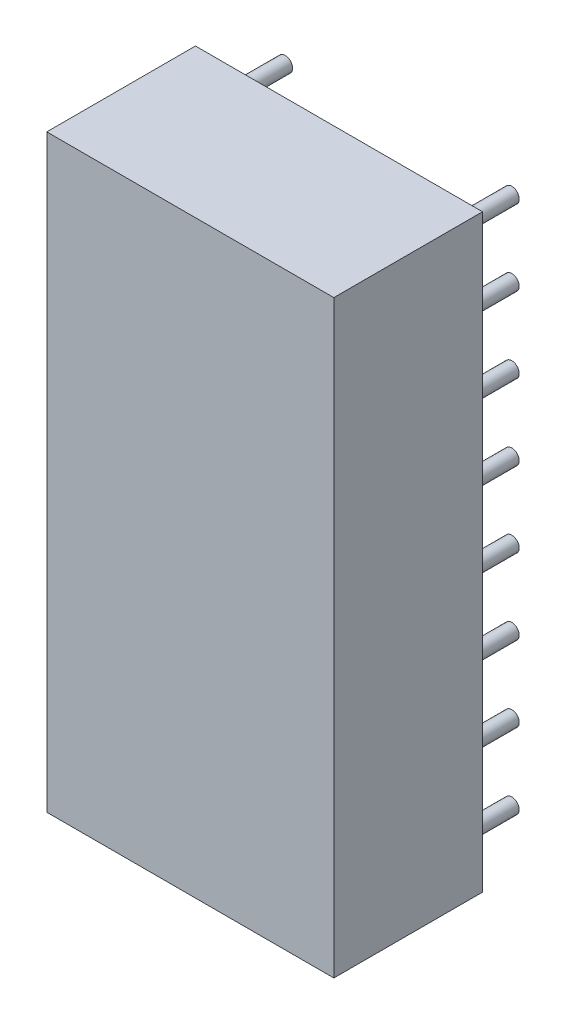
ISO-10303-21;
HEADER;
FILE_DESCRIPTION(('STEP AP214'),'2;1');
FILE_NAME('part.step','',(''),(''),'','','');
FILE_SCHEMA(('AUTOMOTIVE_DESIGN { 1 0 10303 214 1 1 1 1 }'));
ENDSEC;
DATA;
#1=APPLICATION_CONTEXT('core data for automotive mechanical design processes');
#2=APPLICATION_PROTOCOL_DEFINITION('international standard','automotive_design',2000,#1);
#3=PRODUCT_CONTEXT('',#1,'mechanical');
#4=PRODUCT('Part','Part','',(#3));
#5=PRODUCT_RELATED_PRODUCT_CATEGORY('part','',(#4));
#6=PRODUCT_DEFINITION_FORMATION('','',#4);
#7=PRODUCT_DEFINITION_CONTEXT('part definition',#1,'design');
#8=PRODUCT_DEFINITION('design','',#6,#7);
#9=PRODUCT_DEFINITION_SHAPE('','',#8);
#10=(LENGTH_UNIT() NAMED_UNIT(*) SI_UNIT(.MILLI.,.METRE.));
#11=(NAMED_UNIT(*) PLANE_ANGLE_UNIT() SI_UNIT($,.RADIAN.));
#12=(NAMED_UNIT(*) SI_UNIT($,.STERADIAN.) SOLID_ANGLE_UNIT());
#13=UNCERTAINTY_MEASURE_WITH_UNIT(LENGTH_MEASURE(1.E-05),#10,'distance_accuracy_value','');
#14=(GEOMETRIC_REPRESENTATION_CONTEXT(3) GLOBAL_UNCERTAINTY_ASSIGNED_CONTEXT((#13)) GLOBAL_UNIT_ASSIGNED_CONTEXT((#10,
#11,#12)) REPRESENTATION_CONTEXT('',''));
#15=CARTESIAN_POINT('',(0.,0.,0.));
#16=DIRECTION('',(0.,0.,1.));
#17=DIRECTION('',(1.,0.,0.));
#18=AXIS2_PLACEMENT_3D('',#15,#16,#17);
#19=CARTESIAN_POINT('',(8.89,19.05,-2.));
#20=DIRECTION('',(0.,0.,1.));
#21=DIRECTION('',(1.,0.,0.));
#22=AXIS2_PLACEMENT_3D('',#19,#20,#21);
#23=CYLINDRICAL_SURFACE('',#22,0.25);
#24=CARTESIAN_POINT('',(8.89,19.05,-2.));
#25=DIRECTION('',(0.,0.,1.));
#26=DIRECTION('',(1.,0.,0.));
#27=AXIS2_PLACEMENT_3D('',#24,#25,#26);
#28=CIRCLE('',#27,0.25);
#29=CARTESIAN_POINT('',(9.14,19.05,-2.));
#30=VERTEX_POINT('',#29);
#31=EDGE_CURVE('E11',#30,#30,#28,.T.);
#32=ORIENTED_EDGE('',*,*,#31,.T.);
#33=EDGE_LOOP('',(#32));
#34=FACE_BOUND('',#33,.T.);
#35=CARTESIAN_POINT('',(8.89,19.05,0.));
#36=DIRECTION('',(0.,0.,1.));
#37=DIRECTION('',(1.,0.,0.));
#38=AXIS2_PLACEMENT_3D('',#35,#36,#37);
#39=CIRCLE('',#38,0.25);
#40=CARTESIAN_POINT('',(9.14,19.05,0.));
#41=VERTEX_POINT('',#40);
#42=EDGE_CURVE('E43',#41,#41,#39,.T.);
#43=ORIENTED_EDGE('',*,*,#42,.F.);
#44=EDGE_LOOP('',(#43));
#45=FACE_BOUND('',#44,.T.);
#46=ADVANCED_FACE('F40',(#34,#45),#23,.T.);
#47=CARTESIAN_POINT('',(8.89,19.05,-2.));
#48=DIRECTION('',(0.,0.,1.));
#49=DIRECTION('',(1.,0.,0.));
#50=AXIS2_PLACEMENT_3D('',#47,#48,#49);
#51=PLANE('',#50);
#52=ORIENTED_EDGE('',*,*,#31,.F.);
#53=EDGE_LOOP('',(#52));
#54=FACE_BOUND('',#53,.T.);
#55=ADVANCED_FACE('F55',(#54),#51,.F.);
#56=CARTESIAN_POINT('',(8.89,19.05,0.));
#57=DIRECTION('',(0.,0.,1.));
#58=DIRECTION('',(1.,0.,0.));
#59=AXIS2_PLACEMENT_3D('',#56,#57,#58);
#60=PLANE('',#59);
#61=ORIENTED_EDGE('',*,*,#42,.T.);
#62=EDGE_LOOP('',(#61));
#63=FACE_BOUND('',#62,.T.);
#64=ADVANCED_FACE('F52',(#63),#60,.T.);
#65=CLOSED_SHELL('',(#46,#55,#64));
#66=MANIFOLD_SOLID_BREP('B2',#65);
#67=CARTESIAN_POINT('',(8.89,16.51,-2.));
#68=DIRECTION('',(0.,0.,1.));
#69=DIRECTION('',(1.,0.,0.));
#70=AXIS2_PLACEMENT_3D('',#67,#68,#69);
#71=CYLINDRICAL_SURFACE('',#70,0.25);
#72=CARTESIAN_POINT('',(8.89,16.51,-2.));
#73=DIRECTION('',(0.,0.,1.));
#74=DIRECTION('',(1.,0.,0.));
#75=AXIS2_PLACEMENT_3D('',#72,#73,#74);
#76=CIRCLE('',#75,0.25);
#77=CARTESIAN_POINT('',(9.14,16.51,-2.));
#78=VERTEX_POINT('',#77);
#79=EDGE_CURVE('E39',#78,#78,#76,.T.);
#80=ORIENTED_EDGE('',*,*,#79,.T.);
#81=EDGE_LOOP('',(#80));
#82=FACE_BOUND('',#81,.T.);
#83=CARTESIAN_POINT('',(8.89,16.51,0.));
#84=DIRECTION('',(0.,0.,1.));
#85=DIRECTION('',(1.,0.,0.));
#86=AXIS2_PLACEMENT_3D('',#83,#84,#85);
#87=CIRCLE('',#86,0.25);
#88=CARTESIAN_POINT('',(9.14,16.51,0.));
#89=VERTEX_POINT('',#88);
#90=EDGE_CURVE('E92',#89,#89,#87,.T.);
#91=ORIENTED_EDGE('',*,*,#90,.F.);
#92=EDGE_LOOP('',(#91));
#93=FACE_BOUND('',#92,.T.);
#94=ADVANCED_FACE('F89',(#82,#93),#71,.T.);
#95=CARTESIAN_POINT('',(8.89,16.51,-2.));
#96=DIRECTION('',(0.,0.,1.));
#97=DIRECTION('',(1.,0.,0.));
#98=AXIS2_PLACEMENT_3D('',#95,#96,#97);
#99=PLANE('',#98);
#100=ORIENTED_EDGE('',*,*,#79,.F.);
#101=EDGE_LOOP('',(#100));
#102=FACE_BOUND('',#101,.T.);
#103=ADVANCED_FACE('F104',(#102),#99,.F.);
#104=CARTESIAN_POINT('',(8.89,16.51,0.));
#105=DIRECTION('',(0.,0.,1.));
#106=DIRECTION('',(1.,0.,0.));
#107=AXIS2_PLACEMENT_3D('',#104,#105,#106);
#108=PLANE('',#107);
#109=ORIENTED_EDGE('',*,*,#90,.T.);
#110=EDGE_LOOP('',(#109));
#111=FACE_BOUND('',#110,.T.);
#112=ADVANCED_FACE('F101',(#111),#108,.T.);
#113=CLOSED_SHELL('',(#94,#103,#112));
#114=MANIFOLD_SOLID_BREP('B6',#113);
#115=CARTESIAN_POINT('',(8.89,13.97,-2.));
#116=DIRECTION('',(0.,0.,1.));
#117=DIRECTION('',(1.,0.,0.));
#118=AXIS2_PLACEMENT_3D('',#115,#116,#117);
#119=CYLINDRICAL_SURFACE('',#118,0.25);
#120=CARTESIAN_POINT('',(8.89,13.97,-2.));
#121=DIRECTION('',(0.,0.,1.));
#122=DIRECTION('',(1.,0.,0.));
#123=AXIS2_PLACEMENT_3D('',#120,#121,#122);
#124=CIRCLE('',#123,0.25);
#125=CARTESIAN_POINT('',(9.14,13.97,-2.));
#126=VERTEX_POINT('',#125);
#127=EDGE_CURVE('E88',#126,#126,#124,.T.);
#128=ORIENTED_EDGE('',*,*,#127,.T.);
#129=EDGE_LOOP('',(#128));
#130=FACE_BOUND('',#129,.T.);
#131=CARTESIAN_POINT('',(8.89,13.97,0.));
#132=DIRECTION('',(0.,0.,1.));
#133=DIRECTION('',(1.,0.,0.));
#134=AXIS2_PLACEMENT_3D('',#131,#132,#133);
#135=CIRCLE('',#134,0.25);
#136=CARTESIAN_POINT('',(9.14,13.97,0.));
#137=VERTEX_POINT('',#136);
#138=EDGE_CURVE('E141',#137,#137,#135,.T.);
#139=ORIENTED_EDGE('',*,*,#138,.F.);
#140=EDGE_LOOP('',(#139));
#141=FACE_BOUND('',#140,.T.);
#142=ADVANCED_FACE('F138',(#130,#141),#119,.T.);
#143=CARTESIAN_POINT('',(8.89,13.97,-2.));
#144=DIRECTION('',(0.,0.,1.));
#145=DIRECTION('',(1.,0.,0.));
#146=AXIS2_PLACEMENT_3D('',#143,#144,#145);
#147=PLANE('',#146);
#148=ORIENTED_EDGE('',*,*,#127,.F.);
#149=EDGE_LOOP('',(#148));
#150=FACE_BOUND('',#149,.T.);
#151=ADVANCED_FACE('F153',(#150),#147,.F.);
#152=CARTESIAN_POINT('',(8.89,13.97,0.));
#153=DIRECTION('',(0.,0.,1.));
#154=DIRECTION('',(1.,0.,0.));
#155=AXIS2_PLACEMENT_3D('',#152,#153,#154);
#156=PLANE('',#155);
#157=ORIENTED_EDGE('',*,*,#138,.T.);
#158=EDGE_LOOP('',(#157));
#159=FACE_BOUND('',#158,.T.);
#160=ADVANCED_FACE('F150',(#159),#156,.T.);
#161=CLOSED_SHELL('',(#142,#151,#160));
#162=MANIFOLD_SOLID_BREP('B34',#161);
#163=CARTESIAN_POINT('',(8.89,11.43,-2.));
#164=DIRECTION('',(0.,0.,1.));
#165=DIRECTION('',(1.,0.,0.));
#166=AXIS2_PLACEMENT_3D('',#163,#164,#165);
#167=CYLINDRICAL_SURFACE('',#166,0.25);
#168=CARTESIAN_POINT('',(8.89,11.43,-2.));
#169=DIRECTION('',(0.,0.,1.));
#170=DIRECTION('',(1.,0.,0.));
#171=AXIS2_PLACEMENT_3D('',#168,#169,#170);
#172=CIRCLE('',#171,0.25);
#173=CARTESIAN_POINT('',(9.14,11.43,-2.));
#174=VERTEX_POINT('',#173);
#175=EDGE_CURVE('E137',#174,#174,#172,.T.);
#176=ORIENTED_EDGE('',*,*,#175,.T.);
#177=EDGE_LOOP('',(#176));
#178=FACE_BOUND('',#177,.T.);
#179=CARTESIAN_POINT('',(8.89,11.43,0.));
#180=DIRECTION('',(0.,0.,1.));
#181=DIRECTION('',(1.,0.,0.));
#182=AXIS2_PLACEMENT_3D('',#179,#180,#181);
#183=CIRCLE('',#182,0.25);
#184=CARTESIAN_POINT('',(9.14,11.43,0.));
#185=VERTEX_POINT('',#184);
#186=EDGE_CURVE('E190',#185,#185,#183,.T.);
#187=ORIENTED_EDGE('',*,*,#186,.F.);
#188=EDGE_LOOP('',(#187));
#189=FACE_BOUND('',#188,.T.);
#190=ADVANCED_FACE('F187',(#178,#189),#167,.T.);
#191=CARTESIAN_POINT('',(8.89,11.43,-2.));
#192=DIRECTION('',(0.,0.,1.));
#193=DIRECTION('',(1.,0.,0.));
#194=AXIS2_PLACEMENT_3D('',#191,#192,#193);
#195=PLANE('',#194);
#196=ORIENTED_EDGE('',*,*,#175,.F.);
#197=EDGE_LOOP('',(#196));
#198=FACE_BOUND('',#197,.T.);
#199=ADVANCED_FACE('F202',(#198),#195,.F.);
#200=CARTESIAN_POINT('',(8.89,11.43,0.));
#201=DIRECTION('',(0.,0.,1.));
#202=DIRECTION('',(1.,0.,0.));
#203=AXIS2_PLACEMENT_3D('',#200,#201,#202);
#204=PLANE('',#203);
#205=ORIENTED_EDGE('',*,*,#186,.T.);
#206=EDGE_LOOP('',(#205));
#207=FACE_BOUND('',#206,.T.);
#208=ADVANCED_FACE('F199',(#207),#204,.T.);
#209=CLOSED_SHELL('',(#190,#199,#208));
#210=MANIFOLD_SOLID_BREP('B83',#209);
#211=CARTESIAN_POINT('',(8.89,8.89,-2.));
#212=DIRECTION('',(0.,0.,1.));
#213=DIRECTION('',(1.,0.,0.));
#214=AXIS2_PLACEMENT_3D('',#211,#212,#213);
#215=CYLINDRICAL_SURFACE('',#214,0.25);
#216=CARTESIAN_POINT('',(8.89,8.89,-2.));
#217=DIRECTION('',(0.,0.,1.));
#218=DIRECTION('',(1.,0.,0.));
#219=AXIS2_PLACEMENT_3D('',#216,#217,#218);
#220=CIRCLE('',#219,0.25);
#221=CARTESIAN_POINT('',(9.14,8.89,-2.));
#222=VERTEX_POINT('',#221);
#223=EDGE_CURVE('E186',#222,#222,#220,.T.);
#224=ORIENTED_EDGE('',*,*,#223,.T.);
#225=EDGE_LOOP('',(#224));
#226=FACE_BOUND('',#225,.T.);
#227=CARTESIAN_POINT('',(8.89,8.89,0.));
#228=DIRECTION('',(0.,0.,1.));
#229=DIRECTION('',(1.,0.,0.));
#230=AXIS2_PLACEMENT_3D('',#227,#228,#229);
#231=CIRCLE('',#230,0.25);
#232=CARTESIAN_POINT('',(9.14,8.89,0.));
#233=VERTEX_POINT('',#232);
#234=EDGE_CURVE('E239',#233,#233,#231,.T.);
#235=ORIENTED_EDGE('',*,*,#234,.F.);
#236=EDGE_LOOP('',(#235));
#237=FACE_BOUND('',#236,.T.);
#238=ADVANCED_FACE('F236',(#226,#237),#215,.T.);
#239=CARTESIAN_POINT('',(8.89,8.89,-2.));
#240=DIRECTION('',(0.,0.,1.));
#241=DIRECTION('',(1.,0.,0.));
#242=AXIS2_PLACEMENT_3D('',#239,#240,#241);
#243=PLANE('',#242);
#244=ORIENTED_EDGE('',*,*,#223,.F.);
#245=EDGE_LOOP('',(#244));
#246=FACE_BOUND('',#245,.T.);
#247=ADVANCED_FACE('F251',(#246),#243,.F.);
#248=CARTESIAN_POINT('',(8.89,8.89,0.));
#249=DIRECTION('',(0.,0.,1.));
#250=DIRECTION('',(1.,0.,0.));
#251=AXIS2_PLACEMENT_3D('',#248,#249,#250);
#252=PLANE('',#251);
#253=ORIENTED_EDGE('',*,*,#234,.T.);
#254=EDGE_LOOP('',(#253));
#255=FACE_BOUND('',#254,.T.);
#256=ADVANCED_FACE('F248',(#255),#252,.T.);
#257=CLOSED_SHELL('',(#238,#247,#256));
#258=MANIFOLD_SOLID_BREP('B132',#257);
#259=CARTESIAN_POINT('',(8.89,6.35,-2.));
#260=DIRECTION('',(0.,0.,1.));
#261=DIRECTION('',(1.,0.,0.));
#262=AXIS2_PLACEMENT_3D('',#259,#260,#261);
#263=CYLINDRICAL_SURFACE('',#262,0.25);
#264=CARTESIAN_POINT('',(8.89,6.35,-2.));
#265=DIRECTION('',(0.,0.,1.));
#266=DIRECTION('',(1.,0.,0.));
#267=AXIS2_PLACEMENT_3D('',#264,#265,#266);
#268=CIRCLE('',#267,0.25);
#269=CARTESIAN_POINT('',(9.14,6.35,-2.));
#270=VERTEX_POINT('',#269);
#271=EDGE_CURVE('E235',#270,#270,#268,.T.);
#272=ORIENTED_EDGE('',*,*,#271,.T.);
#273=EDGE_LOOP('',(#272));
#274=FACE_BOUND('',#273,.T.);
#275=CARTESIAN_POINT('',(8.89,6.35,0.));
#276=DIRECTION('',(0.,0.,1.));
#277=DIRECTION('',(1.,0.,0.));
#278=AXIS2_PLACEMENT_3D('',#275,#276,#277);
#279=CIRCLE('',#278,0.25);
#280=CARTESIAN_POINT('',(9.14,6.35,0.));
#281=VERTEX_POINT('',#280);
#282=EDGE_CURVE('E288',#281,#281,#279,.T.);
#283=ORIENTED_EDGE('',*,*,#282,.F.);
#284=EDGE_LOOP('',(#283));
#285=FACE_BOUND('',#284,.T.);
#286=ADVANCED_FACE('F285',(#274,#285),#263,.T.);
#287=CARTESIAN_POINT('',(8.89,6.35,-2.));
#288=DIRECTION('',(0.,0.,1.));
#289=DIRECTION('',(1.,0.,0.));
#290=AXIS2_PLACEMENT_3D('',#287,#288,#289);
#291=PLANE('',#290);
#292=ORIENTED_EDGE('',*,*,#271,.F.);
#293=EDGE_LOOP('',(#292));
#294=FACE_BOUND('',#293,.T.);
#295=ADVANCED_FACE('F300',(#294),#291,.F.);
#296=CARTESIAN_POINT('',(8.89,6.35,0.));
#297=DIRECTION('',(0.,0.,1.));
#298=DIRECTION('',(1.,0.,0.));
#299=AXIS2_PLACEMENT_3D('',#296,#297,#298);
#300=PLANE('',#299);
#301=ORIENTED_EDGE('',*,*,#282,.T.);
#302=EDGE_LOOP('',(#301));
#303=FACE_BOUND('',#302,.T.);
#304=ADVANCED_FACE('F297',(#303),#300,.T.);
#305=CLOSED_SHELL('',(#286,#295,#304));
#306=MANIFOLD_SOLID_BREP('B181',#305);
#307=CARTESIAN_POINT('',(8.89,3.81,-2.));
#308=DIRECTION('',(0.,0.,1.));
#309=DIRECTION('',(1.,0.,0.));
#310=AXIS2_PLACEMENT_3D('',#307,#308,#309);
#311=CYLINDRICAL_SURFACE('',#310,0.25);
#312=CARTESIAN_POINT('',(8.89,3.81,-2.));
#313=DIRECTION('',(0.,0.,1.));
#314=DIRECTION('',(1.,0.,0.));
#315=AXIS2_PLACEMENT_3D('',#312,#313,#314);
#316=CIRCLE('',#315,0.25);
#317=CARTESIAN_POINT('',(9.14,3.81,-2.));
#318=VERTEX_POINT('',#317);
#319=EDGE_CURVE('E284',#318,#318,#316,.T.);
#320=ORIENTED_EDGE('',*,*,#319,.T.);
#321=EDGE_LOOP('',(#320));
#322=FACE_BOUND('',#321,.T.);
#323=CARTESIAN_POINT('',(8.89,3.81,0.));
#324=DIRECTION('',(0.,0.,1.));
#325=DIRECTION('',(1.,0.,0.));
#326=AXIS2_PLACEMENT_3D('',#323,#324,#325);
#327=CIRCLE('',#326,0.25);
#328=CARTESIAN_POINT('',(9.14,3.81,0.));
#329=VERTEX_POINT('',#328);
#330=EDGE_CURVE('E337',#329,#329,#327,.T.);
#331=ORIENTED_EDGE('',*,*,#330,.F.);
#332=EDGE_LOOP('',(#331));
#333=FACE_BOUND('',#332,.T.);
#334=ADVANCED_FACE('F334',(#322,#333),#311,.T.);
#335=CARTESIAN_POINT('',(8.89,3.81,-2.));
#336=DIRECTION('',(0.,0.,1.));
#337=DIRECTION('',(1.,0.,0.));
#338=AXIS2_PLACEMENT_3D('',#335,#336,#337);
#339=PLANE('',#338);
#340=ORIENTED_EDGE('',*,*,#319,.F.);
#341=EDGE_LOOP('',(#340));
#342=FACE_BOUND('',#341,.T.);
#343=ADVANCED_FACE('F349',(#342),#339,.F.);
#344=CARTESIAN_POINT('',(8.89,3.81,0.));
#345=DIRECTION('',(0.,0.,1.));
#346=DIRECTION('',(1.,0.,0.));
#347=AXIS2_PLACEMENT_3D('',#344,#345,#346);
#348=PLANE('',#347);
#349=ORIENTED_EDGE('',*,*,#330,.T.);
#350=EDGE_LOOP('',(#349));
#351=FACE_BOUND('',#350,.T.);
#352=ADVANCED_FACE('F346',(#351),#348,.T.);
#353=CLOSED_SHELL('',(#334,#343,#352));
#354=MANIFOLD_SOLID_BREP('B230',#353);
#355=CARTESIAN_POINT('',(8.89,1.27,-2.));
#356=DIRECTION('',(0.,0.,1.));
#357=DIRECTION('',(1.,0.,0.));
#358=AXIS2_PLACEMENT_3D('',#355,#356,#357);
#359=CYLINDRICAL_SURFACE('',#358,0.25);
#360=CARTESIAN_POINT('',(8.89,1.27,-2.));
#361=DIRECTION('',(0.,0.,1.));
#362=DIRECTION('',(1.,0.,0.));
#363=AXIS2_PLACEMENT_3D('',#360,#361,#362);
#364=CIRCLE('',#363,0.25);
#365=CARTESIAN_POINT('',(9.14,1.27,-2.));
#366=VERTEX_POINT('',#365);
#367=EDGE_CURVE('E333',#366,#366,#364,.T.);
#368=ORIENTED_EDGE('',*,*,#367,.T.);
#369=EDGE_LOOP('',(#368));
#370=FACE_BOUND('',#369,.T.);
#371=CARTESIAN_POINT('',(8.89,1.27,0.));
#372=DIRECTION('',(0.,0.,1.));
#373=DIRECTION('',(1.,0.,0.));
#374=AXIS2_PLACEMENT_3D('',#371,#372,#373);
#375=CIRCLE('',#374,0.25);
#376=CARTESIAN_POINT('',(9.14,1.27,0.));
#377=VERTEX_POINT('',#376);
#378=EDGE_CURVE('E386',#377,#377,#375,.T.);
#379=ORIENTED_EDGE('',*,*,#378,.F.);
#380=EDGE_LOOP('',(#379));
#381=FACE_BOUND('',#380,.T.);
#382=ADVANCED_FACE('F383',(#370,#381),#359,.T.);
#383=CARTESIAN_POINT('',(8.89,1.27,-2.));
#384=DIRECTION('',(0.,0.,1.));
#385=DIRECTION('',(1.,0.,0.));
#386=AXIS2_PLACEMENT_3D('',#383,#384,#385);
#387=PLANE('',#386);
#388=ORIENTED_EDGE('',*,*,#367,.F.);
#389=EDGE_LOOP('',(#388));
#390=FACE_BOUND('',#389,.T.);
#391=ADVANCED_FACE('F398',(#390),#387,.F.);
#392=CARTESIAN_POINT('',(8.89,1.27,0.));
#393=DIRECTION('',(0.,0.,1.));
#394=DIRECTION('',(1.,0.,0.));
#395=AXIS2_PLACEMENT_3D('',#392,#393,#394);
#396=PLANE('',#395);
#397=ORIENTED_EDGE('',*,*,#378,.T.);
#398=EDGE_LOOP('',(#397));
#399=FACE_BOUND('',#398,.T.);
#400=ADVANCED_FACE('F395',(#399),#396,.T.);
#401=CLOSED_SHELL('',(#382,#391,#400));
#402=MANIFOLD_SOLID_BREP('B279',#401);
#403=CARTESIAN_POINT('',(1.27,19.05,-2.));
#404=DIRECTION('',(0.,0.,1.));
#405=DIRECTION('',(1.,0.,0.));
#406=AXIS2_PLACEMENT_3D('',#403,#404,#405);
#407=CYLINDRICAL_SURFACE('',#406,0.25);
#408=CARTESIAN_POINT('',(1.27,19.05,-2.));
#409=DIRECTION('',(0.,0.,1.));
#410=DIRECTION('',(1.,0.,0.));
#411=AXIS2_PLACEMENT_3D('',#408,#409,#410);
#412=CIRCLE('',#411,0.25);
#413=CARTESIAN_POINT('',(1.52,19.05,-2.));
#414=VERTEX_POINT('',#413);
#415=EDGE_CURVE('E382',#414,#414,#412,.T.);
#416=ORIENTED_EDGE('',*,*,#415,.T.);
#417=EDGE_LOOP('',(#416));
#418=FACE_BOUND('',#417,.T.);
#419=CARTESIAN_POINT('',(1.27,19.05,0.));
#420=DIRECTION('',(0.,0.,1.));
#421=DIRECTION('',(1.,0.,0.));
#422=AXIS2_PLACEMENT_3D('',#419,#420,#421);
#423=CIRCLE('',#422,0.25);
#424=CARTESIAN_POINT('',(1.52,19.05,0.));
#425=VERTEX_POINT('',#424);
#426=EDGE_CURVE('E435',#425,#425,#423,.T.);
#427=ORIENTED_EDGE('',*,*,#426,.F.);
#428=EDGE_LOOP('',(#427));
#429=FACE_BOUND('',#428,.T.);
#430=ADVANCED_FACE('F432',(#418,#429),#407,.T.);
#431=CARTESIAN_POINT('',(1.27,19.05,-2.));
#432=DIRECTION('',(0.,0.,1.));
#433=DIRECTION('',(1.,0.,0.));
#434=AXIS2_PLACEMENT_3D('',#431,#432,#433);
#435=PLANE('',#434);
#436=ORIENTED_EDGE('',*,*,#415,.F.);
#437=EDGE_LOOP('',(#436));
#438=FACE_BOUND('',#437,.T.);
#439=ADVANCED_FACE('F447',(#438),#435,.F.);
#440=CARTESIAN_POINT('',(1.27,19.05,0.));
#441=DIRECTION('',(0.,0.,1.));
#442=DIRECTION('',(1.,0.,0.));
#443=AXIS2_PLACEMENT_3D('',#440,#441,#442);
#444=PLANE('',#443);
#445=ORIENTED_EDGE('',*,*,#426,.T.);
#446=EDGE_LOOP('',(#445));
#447=FACE_BOUND('',#446,.T.);
#448=ADVANCED_FACE('F444',(#447),#444,.T.);
#449=CLOSED_SHELL('',(#430,#439,#448));
#450=MANIFOLD_SOLID_BREP('B328',#449);
#451=CARTESIAN_POINT('',(1.27,16.51,-2.));
#452=DIRECTION('',(0.,0.,1.));
#453=DIRECTION('',(1.,0.,0.));
#454=AXIS2_PLACEMENT_3D('',#451,#452,#453);
#455=CYLINDRICAL_SURFACE('',#454,0.25);
#456=CARTESIAN_POINT('',(1.27,16.51,-2.));
#457=DIRECTION('',(0.,0.,1.));
#458=DIRECTION('',(1.,0.,0.));
#459=AXIS2_PLACEMENT_3D('',#456,#457,#458);
#460=CIRCLE('',#459,0.25);
#461=CARTESIAN_POINT('',(1.52,16.51,-2.));
#462=VERTEX_POINT('',#461);
#463=EDGE_CURVE('E431',#462,#462,#460,.T.);
#464=ORIENTED_EDGE('',*,*,#463,.T.);
#465=EDGE_LOOP('',(#464));
#466=FACE_BOUND('',#465,.T.);
#467=CARTESIAN_POINT('',(1.27,16.51,0.));
#468=DIRECTION('',(0.,0.,1.));
#469=DIRECTION('',(1.,0.,0.));
#470=AXIS2_PLACEMENT_3D('',#467,#468,#469);
#471=CIRCLE('',#470,0.25);
#472=CARTESIAN_POINT('',(1.52,16.51,0.));
#473=VERTEX_POINT('',#472);
#474=EDGE_CURVE('E484',#473,#473,#471,.T.);
#475=ORIENTED_EDGE('',*,*,#474,.F.);
#476=EDGE_LOOP('',(#475));
#477=FACE_BOUND('',#476,.T.);
#478=ADVANCED_FACE('F481',(#466,#477),#455,.T.);
#479=CARTESIAN_POINT('',(1.27,16.51,-2.));
#480=DIRECTION('',(0.,0.,1.));
#481=DIRECTION('',(1.,0.,0.));
#482=AXIS2_PLACEMENT_3D('',#479,#480,#481);
#483=PLANE('',#482);
#484=ORIENTED_EDGE('',*,*,#463,.F.);
#485=EDGE_LOOP('',(#484));
#486=FACE_BOUND('',#485,.T.);
#487=ADVANCED_FACE('F496',(#486),#483,.F.);
#488=CARTESIAN_POINT('',(1.27,16.51,0.));
#489=DIRECTION('',(0.,0.,1.));
#490=DIRECTION('',(1.,0.,0.));
#491=AXIS2_PLACEMENT_3D('',#488,#489,#490);
#492=PLANE('',#491);
#493=ORIENTED_EDGE('',*,*,#474,.T.);
#494=EDGE_LOOP('',(#493));
#495=FACE_BOUND('',#494,.T.);
#496=ADVANCED_FACE('F493',(#495),#492,.T.);
#497=CLOSED_SHELL('',(#478,#487,#496));
#498=MANIFOLD_SOLID_BREP('B377',#497);
#499=CARTESIAN_POINT('',(1.27,13.97,-2.));
#500=DIRECTION('',(0.,0.,1.));
#501=DIRECTION('',(1.,0.,0.));
#502=AXIS2_PLACEMENT_3D('',#499,#500,#501);
#503=CYLINDRICAL_SURFACE('',#502,0.25);
#504=CARTESIAN_POINT('',(1.27,13.97,-2.));
#505=DIRECTION('',(0.,0.,1.));
#506=DIRECTION('',(1.,0.,0.));
#507=AXIS2_PLACEMENT_3D('',#504,#505,#506);
#508=CIRCLE('',#507,0.25);
#509=CARTESIAN_POINT('',(1.52,13.97,-2.));
#510=VERTEX_POINT('',#509);
#511=EDGE_CURVE('E480',#510,#510,#508,.T.);
#512=ORIENTED_EDGE('',*,*,#511,.T.);
#513=EDGE_LOOP('',(#512));
#514=FACE_BOUND('',#513,.T.);
#515=CARTESIAN_POINT('',(1.27,13.97,0.));
#516=DIRECTION('',(0.,0.,1.));
#517=DIRECTION('',(1.,0.,0.));
#518=AXIS2_PLACEMENT_3D('',#515,#516,#517);
#519=CIRCLE('',#518,0.25);
#520=CARTESIAN_POINT('',(1.52,13.97,0.));
#521=VERTEX_POINT('',#520);
#522=EDGE_CURVE('E533',#521,#521,#519,.T.);
#523=ORIENTED_EDGE('',*,*,#522,.F.);
#524=EDGE_LOOP('',(#523));
#525=FACE_BOUND('',#524,.T.);
#526=ADVANCED_FACE('F530',(#514,#525),#503,.T.);
#527=CARTESIAN_POINT('',(1.27,13.97,-2.));
#528=DIRECTION('',(0.,0.,1.));
#529=DIRECTION('',(1.,0.,0.));
#530=AXIS2_PLACEMENT_3D('',#527,#528,#529);
#531=PLANE('',#530);
#532=ORIENTED_EDGE('',*,*,#511,.F.);
#533=EDGE_LOOP('',(#532));
#534=FACE_BOUND('',#533,.T.);
#535=ADVANCED_FACE('F545',(#534),#531,.F.);
#536=CARTESIAN_POINT('',(1.27,13.97,0.));
#537=DIRECTION('',(0.,0.,1.));
#538=DIRECTION('',(1.,0.,0.));
#539=AXIS2_PLACEMENT_3D('',#536,#537,#538);
#540=PLANE('',#539);
#541=ORIENTED_EDGE('',*,*,#522,.T.);
#542=EDGE_LOOP('',(#541));
#543=FACE_BOUND('',#542,.T.);
#544=ADVANCED_FACE('F542',(#543),#540,.T.);
#545=CLOSED_SHELL('',(#526,#535,#544));
#546=MANIFOLD_SOLID_BREP('B426',#545);
#547=CARTESIAN_POINT('',(1.27,11.43,-2.));
#548=DIRECTION('',(0.,0.,1.));
#549=DIRECTION('',(1.,0.,0.));
#550=AXIS2_PLACEMENT_3D('',#547,#548,#549);
#551=CYLINDRICAL_SURFACE('',#550,0.25);
#552=CARTESIAN_POINT('',(1.27,11.43,-2.));
#553=DIRECTION('',(0.,0.,1.));
#554=DIRECTION('',(1.,0.,0.));
#555=AXIS2_PLACEMENT_3D('',#552,#553,#554);
#556=CIRCLE('',#555,0.25);
#557=CARTESIAN_POINT('',(1.52,11.43,-2.));
#558=VERTEX_POINT('',#557);
#559=EDGE_CURVE('E529',#558,#558,#556,.T.);
#560=ORIENTED_EDGE('',*,*,#559,.T.);
#561=EDGE_LOOP('',(#560));
#562=FACE_BOUND('',#561,.T.);
#563=CARTESIAN_POINT('',(1.27,11.43,0.));
#564=DIRECTION('',(0.,0.,1.));
#565=DIRECTION('',(1.,0.,0.));
#566=AXIS2_PLACEMENT_3D('',#563,#564,#565);
#567=CIRCLE('',#566,0.25);
#568=CARTESIAN_POINT('',(1.52,11.43,0.));
#569=VERTEX_POINT('',#568);
#570=EDGE_CURVE('E582',#569,#569,#567,.T.);
#571=ORIENTED_EDGE('',*,*,#570,.F.);
#572=EDGE_LOOP('',(#571));
#573=FACE_BOUND('',#572,.T.);
#574=ADVANCED_FACE('F579',(#562,#573),#551,.T.);
#575=CARTESIAN_POINT('',(1.27,11.43,-2.));
#576=DIRECTION('',(0.,0.,1.));
#577=DIRECTION('',(1.,0.,0.));
#578=AXIS2_PLACEMENT_3D('',#575,#576,#577);
#579=PLANE('',#578);
#580=ORIENTED_EDGE('',*,*,#559,.F.);
#581=EDGE_LOOP('',(#580));
#582=FACE_BOUND('',#581,.T.);
#583=ADVANCED_FACE('F594',(#582),#579,.F.);
#584=CARTESIAN_POINT('',(1.27,11.43,0.));
#585=DIRECTION('',(0.,0.,1.));
#586=DIRECTION('',(1.,0.,0.));
#587=AXIS2_PLACEMENT_3D('',#584,#585,#586);
#588=PLANE('',#587);
#589=ORIENTED_EDGE('',*,*,#570,.T.);
#590=EDGE_LOOP('',(#589));
#591=FACE_BOUND('',#590,.T.);
#592=ADVANCED_FACE('F591',(#591),#588,.T.);
#593=CLOSED_SHELL('',(#574,#583,#592));
#594=MANIFOLD_SOLID_BREP('B475',#593);
#595=CARTESIAN_POINT('',(1.27,8.89,-2.));
#596=DIRECTION('',(0.,0.,1.));
#597=DIRECTION('',(1.,0.,0.));
#598=AXIS2_PLACEMENT_3D('',#595,#596,#597);
#599=CYLINDRICAL_SURFACE('',#598,0.25);
#600=CARTESIAN_POINT('',(1.27,8.89,-2.));
#601=DIRECTION('',(0.,0.,1.));
#602=DIRECTION('',(1.,0.,0.));
#603=AXIS2_PLACEMENT_3D('',#600,#601,#602);
#604=CIRCLE('',#603,0.25);
#605=CARTESIAN_POINT('',(1.52,8.89,-2.));
#606=VERTEX_POINT('',#605);
#607=EDGE_CURVE('E578',#606,#606,#604,.T.);
#608=ORIENTED_EDGE('',*,*,#607,.T.);
#609=EDGE_LOOP('',(#608));
#610=FACE_BOUND('',#609,.T.);
#611=CARTESIAN_POINT('',(1.27,8.89,0.));
#612=DIRECTION('',(0.,0.,1.));
#613=DIRECTION('',(1.,0.,0.));
#614=AXIS2_PLACEMENT_3D('',#611,#612,#613);
#615=CIRCLE('',#614,0.25);
#616=CARTESIAN_POINT('',(1.52,8.89,0.));
#617=VERTEX_POINT('',#616);
#618=EDGE_CURVE('E631',#617,#617,#615,.T.);
#619=ORIENTED_EDGE('',*,*,#618,.F.);
#620=EDGE_LOOP('',(#619));
#621=FACE_BOUND('',#620,.T.);
#622=ADVANCED_FACE('F628',(#610,#621),#599,.T.);
#623=CARTESIAN_POINT('',(1.27,8.89,-2.));
#624=DIRECTION('',(0.,0.,1.));
#625=DIRECTION('',(1.,0.,0.));
#626=AXIS2_PLACEMENT_3D('',#623,#624,#625);
#627=PLANE('',#626);
#628=ORIENTED_EDGE('',*,*,#607,.F.);
#629=EDGE_LOOP('',(#628));
#630=FACE_BOUND('',#629,.T.);
#631=ADVANCED_FACE('F643',(#630),#627,.F.);
#632=CARTESIAN_POINT('',(1.27,8.89,0.));
#633=DIRECTION('',(0.,0.,1.));
#634=DIRECTION('',(1.,0.,0.));
#635=AXIS2_PLACEMENT_3D('',#632,#633,#634);
#636=PLANE('',#635);
#637=ORIENTED_EDGE('',*,*,#618,.T.);
#638=EDGE_LOOP('',(#637));
#639=FACE_BOUND('',#638,.T.);
#640=ADVANCED_FACE('F640',(#639),#636,.T.);
#641=CLOSED_SHELL('',(#622,#631,#640));
#642=MANIFOLD_SOLID_BREP('B524',#641);
#643=CARTESIAN_POINT('',(1.27,6.35,-2.));
#644=DIRECTION('',(0.,0.,1.));
#645=DIRECTION('',(1.,0.,0.));
#646=AXIS2_PLACEMENT_3D('',#643,#644,#645);
#647=CYLINDRICAL_SURFACE('',#646,0.25);
#648=CARTESIAN_POINT('',(1.27,6.35,-2.));
#649=DIRECTION('',(0.,0.,1.));
#650=DIRECTION('',(1.,0.,0.));
#651=AXIS2_PLACEMENT_3D('',#648,#649,#650);
#652=CIRCLE('',#651,0.25);
#653=CARTESIAN_POINT('',(1.52,6.35,-2.));
#654=VERTEX_POINT('',#653);
#655=EDGE_CURVE('E627',#654,#654,#652,.T.);
#656=ORIENTED_EDGE('',*,*,#655,.T.);
#657=EDGE_LOOP('',(#656));
#658=FACE_BOUND('',#657,.T.);
#659=CARTESIAN_POINT('',(1.27,6.35,0.));
#660=DIRECTION('',(0.,0.,1.));
#661=DIRECTION('',(1.,0.,0.));
#662=AXIS2_PLACEMENT_3D('',#659,#660,#661);
#663=CIRCLE('',#662,0.25);
#664=CARTESIAN_POINT('',(1.52,6.35,0.));
#665=VERTEX_POINT('',#664);
#666=EDGE_CURVE('E680',#665,#665,#663,.T.);
#667=ORIENTED_EDGE('',*,*,#666,.F.);
#668=EDGE_LOOP('',(#667));
#669=FACE_BOUND('',#668,.T.);
#670=ADVANCED_FACE('F677',(#658,#669),#647,.T.);
#671=CARTESIAN_POINT('',(1.27,6.35,-2.));
#672=DIRECTION('',(0.,0.,1.));
#673=DIRECTION('',(1.,0.,0.));
#674=AXIS2_PLACEMENT_3D('',#671,#672,#673);
#675=PLANE('',#674);
#676=ORIENTED_EDGE('',*,*,#655,.F.);
#677=EDGE_LOOP('',(#676));
#678=FACE_BOUND('',#677,.T.);
#679=ADVANCED_FACE('F692',(#678),#675,.F.);
#680=CARTESIAN_POINT('',(1.27,6.35,0.));
#681=DIRECTION('',(0.,0.,1.));
#682=DIRECTION('',(1.,0.,0.));
#683=AXIS2_PLACEMENT_3D('',#680,#681,#682);
#684=PLANE('',#683);
#685=ORIENTED_EDGE('',*,*,#666,.T.);
#686=EDGE_LOOP('',(#685));
#687=FACE_BOUND('',#686,.T.);
#688=ADVANCED_FACE('F689',(#687),#684,.T.);
#689=CLOSED_SHELL('',(#670,#679,#688));
#690=MANIFOLD_SOLID_BREP('B573',#689);
#691=CARTESIAN_POINT('',(1.27,3.81,-2.));
#692=DIRECTION('',(0.,0.,1.));
#693=DIRECTION('',(1.,0.,0.));
#694=AXIS2_PLACEMENT_3D('',#691,#692,#693);
#695=CYLINDRICAL_SURFACE('',#694,0.25);
#696=CARTESIAN_POINT('',(1.27,3.81,-2.));
#697=DIRECTION('',(0.,0.,1.));
#698=DIRECTION('',(1.,0.,0.));
#699=AXIS2_PLACEMENT_3D('',#696,#697,#698);
#700=CIRCLE('',#699,0.25);
#701=CARTESIAN_POINT('',(1.52,3.81,-2.));
#702=VERTEX_POINT('',#701);
#703=EDGE_CURVE('E676',#702,#702,#700,.T.);
#704=ORIENTED_EDGE('',*,*,#703,.T.);
#705=EDGE_LOOP('',(#704));
#706=FACE_BOUND('',#705,.T.);
#707=CARTESIAN_POINT('',(1.27,3.81,0.));
#708=DIRECTION('',(0.,0.,1.));
#709=DIRECTION('',(1.,0.,0.));
#710=AXIS2_PLACEMENT_3D('',#707,#708,#709);
#711=CIRCLE('',#710,0.25);
#712=CARTESIAN_POINT('',(1.52,3.81,0.));
#713=VERTEX_POINT('',#712);
#714=EDGE_CURVE('E729',#713,#713,#711,.T.);
#715=ORIENTED_EDGE('',*,*,#714,.F.);
#716=EDGE_LOOP('',(#715));
#717=FACE_BOUND('',#716,.T.);
#718=ADVANCED_FACE('F726',(#706,#717),#695,.T.);
#719=CARTESIAN_POINT('',(1.27,3.81,-2.));
#720=DIRECTION('',(0.,0.,1.));
#721=DIRECTION('',(1.,0.,0.));
#722=AXIS2_PLACEMENT_3D('',#719,#720,#721);
#723=PLANE('',#722);
#724=ORIENTED_EDGE('',*,*,#703,.F.);
#725=EDGE_LOOP('',(#724));
#726=FACE_BOUND('',#725,.T.);
#727=ADVANCED_FACE('F741',(#726),#723,.F.);
#728=CARTESIAN_POINT('',(1.27,3.81,0.));
#729=DIRECTION('',(0.,0.,1.));
#730=DIRECTION('',(1.,0.,0.));
#731=AXIS2_PLACEMENT_3D('',#728,#729,#730);
#732=PLANE('',#731);
#733=ORIENTED_EDGE('',*,*,#714,.T.);
#734=EDGE_LOOP('',(#733));
#735=FACE_BOUND('',#734,.T.);
#736=ADVANCED_FACE('F738',(#735),#732,.T.);
#737=CLOSED_SHELL('',(#718,#727,#736));
#738=MANIFOLD_SOLID_BREP('B622',#737);
#739=CARTESIAN_POINT('',(1.27,1.27,-2.));
#740=DIRECTION('',(0.,0.,1.));
#741=DIRECTION('',(1.,0.,0.));
#742=AXIS2_PLACEMENT_3D('',#739,#740,#741);
#743=CYLINDRICAL_SURFACE('',#742,0.25);
#744=CARTESIAN_POINT('',(1.27,1.27,-2.));
#745=DIRECTION('',(0.,0.,1.));
#746=DIRECTION('',(1.,0.,0.));
#747=AXIS2_PLACEMENT_3D('',#744,#745,#746);
#748=CIRCLE('',#747,0.25);
#749=CARTESIAN_POINT('',(1.52,1.27,-2.));
#750=VERTEX_POINT('',#749);
#751=EDGE_CURVE('E725',#750,#750,#748,.T.);
#752=ORIENTED_EDGE('',*,*,#751,.T.);
#753=EDGE_LOOP('',(#752));
#754=FACE_BOUND('',#753,.T.);
#755=CARTESIAN_POINT('',(1.27,1.27,0.));
#756=DIRECTION('',(0.,0.,1.));
#757=DIRECTION('',(1.,0.,0.));
#758=AXIS2_PLACEMENT_3D('',#755,#756,#757);
#759=CIRCLE('',#758,0.25);
#760=CARTESIAN_POINT('',(1.52,1.27,0.));
#761=VERTEX_POINT('',#760);
#762=EDGE_CURVE('E779',#761,#761,#759,.T.);
#763=ORIENTED_EDGE('',*,*,#762,.F.);
#764=EDGE_LOOP('',(#763));
#765=FACE_BOUND('',#764,.T.);
#766=ADVANCED_FACE('F776',(#754,#765),#743,.T.);
#767=CARTESIAN_POINT('',(1.27,1.27,-2.));
#768=DIRECTION('',(0.,0.,1.));
#769=DIRECTION('',(1.,0.,0.));
#770=AXIS2_PLACEMENT_3D('',#767,#768,#769);
#771=PLANE('',#770);
#772=ORIENTED_EDGE('',*,*,#751,.F.);
#773=EDGE_LOOP('',(#772));
#774=FACE_BOUND('',#773,.T.);
#775=ADVANCED_FACE('F791',(#774),#771,.F.);
#776=CARTESIAN_POINT('',(1.27,1.27,0.));
#777=DIRECTION('',(0.,0.,1.));
#778=DIRECTION('',(1.,0.,0.));
#779=AXIS2_PLACEMENT_3D('',#776,#777,#778);
#780=PLANE('',#779);
#781=ORIENTED_EDGE('',*,*,#762,.T.);
#782=EDGE_LOOP('',(#781));
#783=FACE_BOUND('',#782,.T.);
#784=ADVANCED_FACE('F788',(#783),#780,.T.);
#785=CLOSED_SHELL('',(#766,#775,#784));
#786=MANIFOLD_SOLID_BREP('B671',#785);
#787=CARTESIAN_POINT('',(0.254,20.066,5.));
#788=DIRECTION('',(1.,0.,0.));
#789=DIRECTION('',(0.,0.,-1.));
#790=AXIS2_PLACEMENT_3D('',#787,#788,#789);
#791=PLANE('',#790);
#792=DIRECTION('',(0.,-1.,0.));
#793=VECTOR('',#792,1.);
#794=CARTESIAN_POINT('',(0.254,20.066,0.));
#795=LINE('',#794,#793);
#796=CARTESIAN_POINT('',(0.254,20.066,0.));
#797=VERTEX_POINT('',#796);
#798=CARTESIAN_POINT('',(0.254,0.254,0.));
#799=VERTEX_POINT('',#798);
#800=EDGE_CURVE('E880',#797,#799,#795,.T.);
#801=ORIENTED_EDGE('',*,*,#800,.T.);
#802=DIRECTION('',(0.,0.,-1.));
#803=VECTOR('',#802,1.);
#804=CARTESIAN_POINT('',(0.254,0.254,5.));
#805=LINE('',#804,#803);
#806=CARTESIAN_POINT('',(0.254,0.254,5.));
#807=VERTEX_POINT('',#806);
#808=EDGE_CURVE('E774',#807,#799,#805,.T.);
#809=ORIENTED_EDGE('',*,*,#808,.F.);
#810=DIRECTION('',(0.,-1.,0.));
#811=VECTOR('',#810,1.);
#812=CARTESIAN_POINT('',(0.254,20.066,5.));
#813=LINE('',#812,#811);
#814=CARTESIAN_POINT('',(0.254,20.066,5.));
#815=VERTEX_POINT('',#814);
#816=EDGE_CURVE('E868',#815,#807,#813,.T.);
#817=ORIENTED_EDGE('',*,*,#816,.F.);
#818=DIRECTION('',(0.,0.,-1.));
#819=VECTOR('',#818,1.);
#820=CARTESIAN_POINT('',(0.254,20.066,5.));
#821=LINE('',#820,#819);
#822=EDGE_CURVE('E876',#815,#797,#821,.T.);
#823=ORIENTED_EDGE('',*,*,#822,.T.);
#824=EDGE_LOOP('',(#801,#809,#817,#823));
#825=FACE_BOUND('',#824,.T.);
#826=ADVANCED_FACE('F817',(#825),#791,.F.);
#827=CARTESIAN_POINT('',(0.254,0.254,5.));
#828=DIRECTION('',(0.,1.,0.));
#829=DIRECTION('',(0.,0.,1.));
#830=AXIS2_PLACEMENT_3D('',#827,#828,#829);
#831=PLANE('',#830);
#832=DIRECTION('',(1.,0.,0.));
#833=VECTOR('',#832,1.);
#834=CARTESIAN_POINT('',(0.254,0.254,0.));
#835=LINE('',#834,#833);
#836=CARTESIAN_POINT('',(9.906,0.254,0.));
#837=VERTEX_POINT('',#836);
#838=EDGE_CURVE('E872',#799,#837,#835,.T.);
#839=ORIENTED_EDGE('',*,*,#838,.T.);
#840=DIRECTION('',(0.,0.,-1.));
#841=VECTOR('',#840,1.);
#842=CARTESIAN_POINT('',(9.906,0.254,5.));
#843=LINE('',#842,#841);
#844=CARTESIAN_POINT('',(9.906,0.254,5.));
#845=VERTEX_POINT('',#844);
#846=EDGE_CURVE('E825',#845,#837,#843,.T.);
#847=ORIENTED_EDGE('',*,*,#846,.F.);
#848=DIRECTION('',(1.,0.,0.));
#849=VECTOR('',#848,1.);
#850=CARTESIAN_POINT('',(0.254,0.254,5.));
#851=LINE('',#850,#849);
#852=EDGE_CURVE('E863',#807,#845,#851,.T.);
#853=ORIENTED_EDGE('',*,*,#852,.F.);
#854=ORIENTED_EDGE('',*,*,#808,.T.);
#855=EDGE_LOOP('',(#839,#847,#853,#854));
#856=FACE_BOUND('',#855,.T.);
#857=ADVANCED_FACE('F871',(#856),#831,.F.);
#858=CARTESIAN_POINT('',(9.906,0.254,5.));
#859=DIRECTION('',(-1.,0.,0.));
#860=DIRECTION('',(0.,0.,1.));
#861=AXIS2_PLACEMENT_3D('',#858,#859,#860);
#862=PLANE('',#861);
#863=DIRECTION('',(0.,1.,0.));
#864=VECTOR('',#863,1.);
#865=CARTESIAN_POINT('',(9.906,0.254,0.));
#866=LINE('',#865,#864);
#867=CARTESIAN_POINT('',(9.906,20.066,0.));
#868=VERTEX_POINT('',#867);
#869=EDGE_CURVE('E850',#837,#868,#866,.T.);
#870=ORIENTED_EDGE('',*,*,#869,.T.);
#871=DIRECTION('',(0.,0.,-1.));
#872=VECTOR('',#871,1.);
#873=CARTESIAN_POINT('',(9.906,20.066,5.));
#874=LINE('',#873,#872);
#875=CARTESIAN_POINT('',(9.906,20.066,5.));
#876=VERTEX_POINT('',#875);
#877=EDGE_CURVE('E873',#876,#868,#874,.T.);
#878=ORIENTED_EDGE('',*,*,#877,.F.);
#879=DIRECTION('',(0.,1.,0.));
#880=VECTOR('',#879,1.);
#881=CARTESIAN_POINT('',(9.906,0.254,5.));
#882=LINE('',#881,#880);
#883=EDGE_CURVE('E866',#845,#876,#882,.T.);
#884=ORIENTED_EDGE('',*,*,#883,.F.);
#885=ORIENTED_EDGE('',*,*,#846,.T.);
#886=EDGE_LOOP('',(#870,#878,#884,#885));
#887=FACE_BOUND('',#886,.T.);
#888=ADVANCED_FACE('F874',(#887),#862,.F.);
#889=CARTESIAN_POINT('',(9.906,20.066,5.));
#890=DIRECTION('',(0.,-1.,0.));
#891=DIRECTION('',(0.,0.,-1.));
#892=AXIS2_PLACEMENT_3D('',#889,#890,#891);
#893=PLANE('',#892);
#894=DIRECTION('',(-1.,0.,0.));
#895=VECTOR('',#894,1.);
#896=CARTESIAN_POINT('',(9.906,20.066,0.));
#897=LINE('',#896,#895);
#898=EDGE_CURVE('E856',#868,#797,#897,.T.);
#899=ORIENTED_EDGE('',*,*,#898,.T.);
#900=ORIENTED_EDGE('',*,*,#822,.F.);
#901=DIRECTION('',(-1.,0.,0.));
#902=VECTOR('',#901,1.);
#903=CARTESIAN_POINT('',(9.906,20.066,5.));
#904=LINE('',#903,#902);
#905=EDGE_CURVE('E833',#876,#815,#904,.T.);
#906=ORIENTED_EDGE('',*,*,#905,.F.);
#907=ORIENTED_EDGE('',*,*,#877,.T.);
#908=EDGE_LOOP('',(#899,#900,#906,#907));
#909=FACE_BOUND('',#908,.T.);
#910=ADVANCED_FACE('F887',(#909),#893,.F.);
#911=CARTESIAN_POINT('',(0.,0.,5.));
#912=DIRECTION('',(0.,0.,1.));
#913=DIRECTION('',(1.,0.,0.));
#914=AXIS2_PLACEMENT_3D('',#911,#912,#913);
#915=PLANE('',#914);
#916=ORIENTED_EDGE('',*,*,#816,.T.);
#917=ORIENTED_EDGE('',*,*,#852,.T.);
#918=ORIENTED_EDGE('',*,*,#883,.T.);
#919=ORIENTED_EDGE('',*,*,#905,.T.);
#920=EDGE_LOOP('',(#916,#917,#918,#919));
#921=FACE_BOUND('',#920,.T.);
#922=ADVANCED_FACE('F864',(#921),#915,.T.);
#923=CARTESIAN_POINT('',(0.,0.,0.));
#924=DIRECTION('',(0.,0.,1.));
#925=DIRECTION('',(1.,0.,0.));
#926=AXIS2_PLACEMENT_3D('',#923,#924,#925);
#927=PLANE('',#926);
#928=ORIENTED_EDGE('',*,*,#800,.F.);
#929=ORIENTED_EDGE('',*,*,#898,.F.);
#930=ORIENTED_EDGE('',*,*,#869,.F.);
#931=ORIENTED_EDGE('',*,*,#838,.F.);
#932=EDGE_LOOP('',(#928,#929,#930,#931));
#933=FACE_BOUND('',#932,.T.);
#934=ADVANCED_FACE('F890',(#933),#927,.F.);
#935=CLOSED_SHELL('',(#826,#857,#888,#910,#922,#934));
#936=MANIFOLD_SOLID_BREP('B720',#935);
#937=ADVANCED_BREP_SHAPE_REPRESENTATION('',(#18,#66,#114,#162,#210,#258,#306,#354,#402,#450,
#498,#546,#594,#642,#690,#738,#786,#936),#14);
#938=SHAPE_DEFINITION_REPRESENTATION(#9,#937);
ENDSEC;
END-ISO-10303-21;
